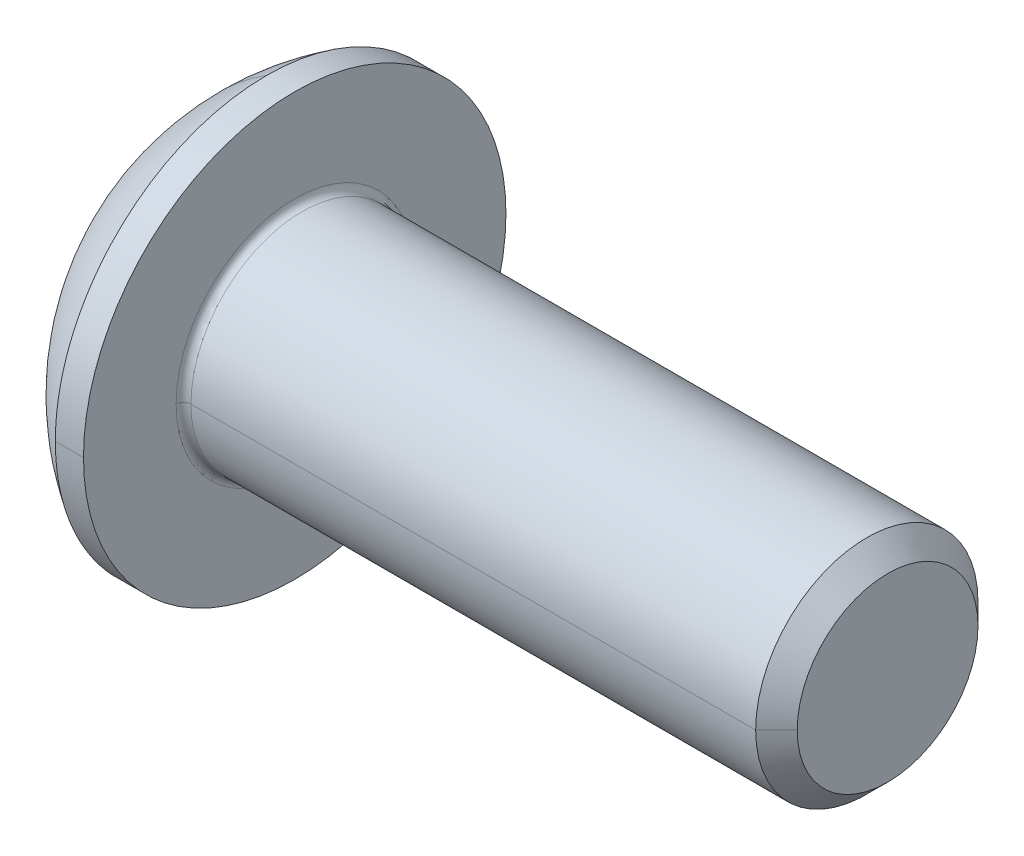
ISO-10303-21;
HEADER;
FILE_DESCRIPTION(('STEP AP214'),'2;1');
FILE_NAME('part.step','',(''),(''),'','','');
FILE_SCHEMA(('AUTOMOTIVE_DESIGN { 1 0 10303 214 1 1 1 1 }'));
ENDSEC;
DATA;
#1=APPLICATION_CONTEXT('core data for automotive mechanical design processes');
#2=APPLICATION_PROTOCOL_DEFINITION('international standard','automotive_design',2000,#1);
#3=PRODUCT_CONTEXT('',#1,'mechanical');
#4=PRODUCT('Part','Part','',(#3));
#5=PRODUCT_RELATED_PRODUCT_CATEGORY('part','',(#4));
#6=PRODUCT_DEFINITION_FORMATION('','',#4);
#7=PRODUCT_DEFINITION_CONTEXT('part definition',#1,'design');
#8=PRODUCT_DEFINITION('design','',#6,#7);
#9=PRODUCT_DEFINITION_SHAPE('','',#8);
#10=(LENGTH_UNIT() NAMED_UNIT(*) SI_UNIT(.MILLI.,.METRE.));
#11=(NAMED_UNIT(*) PLANE_ANGLE_UNIT() SI_UNIT($,.RADIAN.));
#12=(NAMED_UNIT(*) SI_UNIT($,.STERADIAN.) SOLID_ANGLE_UNIT());
#13=UNCERTAINTY_MEASURE_WITH_UNIT(LENGTH_MEASURE(1.E-05),#10,'distance_accuracy_value','');
#14=(GEOMETRIC_REPRESENTATION_CONTEXT(3) GLOBAL_UNCERTAINTY_ASSIGNED_CONTEXT((#13)) GLOBAL_UNIT_ASSIGNED_CONTEXT((#10,
#11,#12)) REPRESENTATION_CONTEXT('',''));
#15=CARTESIAN_POINT('',(0.,0.,0.));
#16=DIRECTION('',(0.,0.,1.));
#17=DIRECTION('',(1.,0.,0.));
#18=AXIS2_PLACEMENT_3D('',#15,#16,#17);
#19=CARTESIAN_POINT('',(-998.38264973081,0.,0.));
#20=DIRECTION('',(-1.,0.,0.));
#21=DIRECTION('',(0.,0.,1.));
#22=AXIS2_PLACEMENT_3D('',#19,#20,#21);
#23=CONICAL_SURFACE('',#22,1732.05080756885,1.0471975511966);
#24=DIRECTION('',(-0.5,0.,-0.866025403784436));
#25=VECTOR('',#24,1.);
#26=CARTESIAN_POINT('',(1.61735026918964,0.,0.));
#27=LINE('',#26,#25);
#28=CARTESIAN_POINT('',(1.61735026918964,0.,0.));
#29=VERTEX_POINT('',#28);
#30=CARTESIAN_POINT('',(1.04,0.,-1.));
#31=VERTEX_POINT('',#30);
#32=EDGE_CURVE('E219',#29,#31,#27,.T.);
#33=ORIENTED_EDGE('',*,*,#32,.F.);
#34=DIRECTION('',(-0.5,0.,0.866025403784436));
#35=VECTOR('',#34,1.);
#36=CARTESIAN_POINT('',(1.61735026918964,0.,0.));
#37=LINE('',#36,#35);
#38=CARTESIAN_POINT('',(1.04,0.,1.));
#39=VERTEX_POINT('',#38);
#40=EDGE_CURVE('E226',#29,#39,#37,.T.);
#41=ORIENTED_EDGE('',*,*,#40,.T.);
#42=CARTESIAN_POINT('',(1.04,0.,0.));
#43=DIRECTION('',(-1.,0.,0.));
#44=DIRECTION('',(0.,0.,1.));
#45=AXIS2_PLACEMENT_3D('',#42,#43,#44);
#46=CIRCLE('',#45,1.);
#47=CARTESIAN_POINT('',(1.04,0.86602540378444,0.5));
#48=VERTEX_POINT('',#47);
#49=EDGE_CURVE('E11',#39,#48,#46,.T.);
#50=ORIENTED_EDGE('',*,*,#49,.T.);
#51=CARTESIAN_POINT('',(1.04,0.,0.));
#52=DIRECTION('',(-1.,0.,0.));
#53=DIRECTION('',(0.,0.,1.));
#54=AXIS2_PLACEMENT_3D('',#51,#52,#53);
#55=CIRCLE('',#54,1.);
#56=CARTESIAN_POINT('',(1.04,0.86602540378444,-0.5));
#57=VERTEX_POINT('',#56);
#58=EDGE_CURVE('E25',#48,#57,#55,.T.);
#59=ORIENTED_EDGE('',*,*,#58,.T.);
#60=CARTESIAN_POINT('',(1.04,0.,0.));
#61=DIRECTION('',(-1.,0.,0.));
#62=DIRECTION('',(0.,0.,1.));
#63=AXIS2_PLACEMENT_3D('',#60,#61,#62);
#64=CIRCLE('',#63,1.);
#65=EDGE_CURVE('E19',#57,#31,#64,.T.);
#66=ORIENTED_EDGE('',*,*,#65,.T.);
#67=EDGE_LOOP('',(#33,#41,#50,#59,#66));
#68=FACE_BOUND('',#67,.T.);
#69=ADVANCED_FACE('F16',(#68),#23,.F.);
#70=CARTESIAN_POINT('',(1.04,-1.73205080756887,-1.));
#71=DIRECTION('',(1.,0.,0.));
#72=DIRECTION('',(0.,1.,0.));
#73=AXIS2_PLACEMENT_3D('',#70,#71,#72);
#74=PLANE('',#73);
#75=CARTESIAN_POINT('',(1.04,0.,0.));
#76=DIRECTION('',(-1.,0.,0.));
#77=DIRECTION('',(0.,0.,1.));
#78=AXIS2_PLACEMENT_3D('',#75,#76,#77);
#79=CIRCLE('',#78,1.);
#80=CARTESIAN_POINT('',(1.04,-0.86602540378444,-0.5));
#81=VERTEX_POINT('',#80);
#82=EDGE_CURVE('E187',#31,#81,#79,.T.);
#83=ORIENTED_EDGE('',*,*,#82,.F.);
#84=DIRECTION('',(0.,1.,0.));
#85=VECTOR('',#84,1.);
#86=CARTESIAN_POINT('',(1.04,0.577350269189628,-1.));
#87=LINE('',#86,#85);
#88=CARTESIAN_POINT('',(1.04,-0.577350269189626,-1.));
#89=VERTEX_POINT('',#88);
#90=EDGE_CURVE('E190',#89,#31,#87,.T.);
#91=ORIENTED_EDGE('',*,*,#90,.F.);
#92=DIRECTION('',(0.,0.5,-0.86602540378444));
#93=VECTOR('',#92,1.);
#94=CARTESIAN_POINT('',(1.04,-0.577350269189626,-1.));
#95=LINE('',#94,#93);
#96=EDGE_CURVE('E183',#81,#89,#95,.T.);
#97=ORIENTED_EDGE('',*,*,#96,.F.);
#98=EDGE_LOOP('',(#83,#91,#97));
#99=FACE_BOUND('',#98,.T.);
#100=ADVANCED_FACE('F185',(#99),#74,.F.);
#101=CARTESIAN_POINT('',(1.04,-1.73205080756887,-1.));
#102=DIRECTION('',(1.,0.,0.));
#103=DIRECTION('',(0.,1.,0.));
#104=AXIS2_PLACEMENT_3D('',#101,#102,#103);
#105=PLANE('',#104);
#106=CARTESIAN_POINT('',(1.04,0.,0.));
#107=DIRECTION('',(-1.,0.,0.));
#108=DIRECTION('',(0.,0.,1.));
#109=AXIS2_PLACEMENT_3D('',#106,#107,#108);
#110=CIRCLE('',#109,1.);
#111=CARTESIAN_POINT('',(1.04,-0.866025403784437,0.5));
#112=VERTEX_POINT('',#111);
#113=EDGE_CURVE('E208',#81,#112,#110,.T.);
#114=ORIENTED_EDGE('',*,*,#113,.F.);
#115=DIRECTION('',(0.,0.5,-0.86602540378444));
#116=VECTOR('',#115,1.);
#117=CARTESIAN_POINT('',(1.04,-0.577350269189626,-1.));
#118=LINE('',#117,#116);
#119=CARTESIAN_POINT('',(1.04,-1.15470053837925,0.));
#120=VERTEX_POINT('',#119);
#121=EDGE_CURVE('E195',#120,#81,#118,.T.);
#122=ORIENTED_EDGE('',*,*,#121,.F.);
#123=DIRECTION('',(0.,-0.5,-0.866025403784439));
#124=VECTOR('',#123,1.);
#125=CARTESIAN_POINT('',(1.04,-1.15470053837925,0.));
#126=LINE('',#125,#124);
#127=EDGE_CURVE('E210',#112,#120,#126,.T.);
#128=ORIENTED_EDGE('',*,*,#127,.F.);
#129=EDGE_LOOP('',(#114,#122,#128));
#130=FACE_BOUND('',#129,.T.);
#131=ADVANCED_FACE('F209',(#130),#105,.F.);
#132=CARTESIAN_POINT('',(1.04,-1.73205080756887,-1.));
#133=DIRECTION('',(1.,0.,0.));
#134=DIRECTION('',(0.,1.,0.));
#135=AXIS2_PLACEMENT_3D('',#132,#133,#134);
#136=PLANE('',#135);
#137=CARTESIAN_POINT('',(1.04,0.,0.));
#138=DIRECTION('',(-1.,0.,0.));
#139=DIRECTION('',(0.,0.,1.));
#140=AXIS2_PLACEMENT_3D('',#137,#138,#139);
#141=CIRCLE('',#140,1.);
#142=EDGE_CURVE('E215',#112,#39,#141,.T.);
#143=ORIENTED_EDGE('',*,*,#142,.F.);
#144=DIRECTION('',(0.,-0.5,-0.866025403784439));
#145=VECTOR('',#144,1.);
#146=CARTESIAN_POINT('',(1.04,-1.15470053837925,0.));
#147=LINE('',#146,#145);
#148=CARTESIAN_POINT('',(1.04,-0.577350269189625,1.));
#149=VERTEX_POINT('',#148);
#150=EDGE_CURVE('E371',#149,#112,#147,.T.);
#151=ORIENTED_EDGE('',*,*,#150,.F.);
#152=DIRECTION('',(0.,-1.,0.));
#153=VECTOR('',#152,1.);
#154=CARTESIAN_POINT('',(1.04,-0.577350269189625,1.));
#155=LINE('',#154,#153);
#156=EDGE_CURVE('E397',#39,#149,#155,.T.);
#157=ORIENTED_EDGE('',*,*,#156,.F.);
#158=EDGE_LOOP('',(#143,#151,#157));
#159=FACE_BOUND('',#158,.T.);
#160=ADVANCED_FACE('F426',(#159),#136,.F.);
#161=CARTESIAN_POINT('',(1.04,-1.73205080756887,-1.));
#162=DIRECTION('',(1.,0.,0.));
#163=DIRECTION('',(0.,1.,0.));
#164=AXIS2_PLACEMENT_3D('',#161,#162,#163);
#165=PLANE('',#164);
#166=ORIENTED_EDGE('',*,*,#49,.F.);
#167=DIRECTION('',(0.,-1.,0.));
#168=VECTOR('',#167,1.);
#169=CARTESIAN_POINT('',(1.04,-0.577350269189625,1.));
#170=LINE('',#169,#168);
#171=CARTESIAN_POINT('',(1.04,0.577350269189628,1.));
#172=VERTEX_POINT('',#171);
#173=EDGE_CURVE('E39',#172,#39,#170,.T.);
#174=ORIENTED_EDGE('',*,*,#173,.F.);
#175=DIRECTION('',(0.,-0.5,0.86602540378444));
#176=VECTOR('',#175,1.);
#177=CARTESIAN_POINT('',(1.04,0.577350269189628,1.));
#178=LINE('',#177,#176);
#179=EDGE_CURVE('E301',#48,#172,#178,.T.);
#180=ORIENTED_EDGE('',*,*,#179,.F.);
#181=EDGE_LOOP('',(#166,#174,#180));
#182=FACE_BOUND('',#181,.T.);
#183=ADVANCED_FACE('F871',(#182),#165,.F.);
#184=CARTESIAN_POINT('',(1.04,-1.73205080756887,-1.));
#185=DIRECTION('',(1.,0.,0.));
#186=DIRECTION('',(0.,1.,0.));
#187=AXIS2_PLACEMENT_3D('',#184,#185,#186);
#188=PLANE('',#187);
#189=ORIENTED_EDGE('',*,*,#58,.F.);
#190=DIRECTION('',(0.,-0.5,0.86602540378444));
#191=VECTOR('',#190,1.);
#192=CARTESIAN_POINT('',(1.04,0.577350269189628,1.));
#193=LINE('',#192,#191);
#194=CARTESIAN_POINT('',(1.04,1.15470053837925,0.));
#195=VERTEX_POINT('',#194);
#196=EDGE_CURVE('E297',#195,#48,#193,.T.);
#197=ORIENTED_EDGE('',*,*,#196,.F.);
#198=DIRECTION('',(0.,0.5,0.86602540378444));
#199=VECTOR('',#198,1.);
#200=CARTESIAN_POINT('',(1.04,1.15470053837925,0.));
#201=LINE('',#200,#199);
#202=EDGE_CURVE('E269',#57,#195,#201,.T.);
#203=ORIENTED_EDGE('',*,*,#202,.F.);
#204=EDGE_LOOP('',(#189,#197,#203));
#205=FACE_BOUND('',#204,.T.);
#206=ADVANCED_FACE('F866',(#205),#188,.F.);
#207=CARTESIAN_POINT('',(1.04,-1.73205080756887,-1.));
#208=DIRECTION('',(1.,0.,0.));
#209=DIRECTION('',(0.,1.,0.));
#210=AXIS2_PLACEMENT_3D('',#207,#208,#209);
#211=PLANE('',#210);
#212=ORIENTED_EDGE('',*,*,#65,.F.);
#213=DIRECTION('',(0.,0.5,0.86602540378444));
#214=VECTOR('',#213,1.);
#215=CARTESIAN_POINT('',(1.04,1.15470053837925,0.));
#216=LINE('',#215,#214);
#217=CARTESIAN_POINT('',(1.04,0.577350269189628,-1.));
#218=VERTEX_POINT('',#217);
#219=EDGE_CURVE('E265',#218,#57,#216,.T.);
#220=ORIENTED_EDGE('',*,*,#219,.F.);
#221=DIRECTION('',(0.,1.,0.));
#222=VECTOR('',#221,1.);
#223=CARTESIAN_POINT('',(1.04,0.577350269189628,-1.));
#224=LINE('',#223,#222);
#225=EDGE_CURVE('E368',#31,#218,#224,.T.);
#226=ORIENTED_EDGE('',*,*,#225,.F.);
#227=EDGE_LOOP('',(#212,#220,#226));
#228=FACE_BOUND('',#227,.T.);
#229=ADVANCED_FACE('F411',(#228),#211,.F.);
#230=CARTESIAN_POINT('',(1.04,-0.577350269189625,1.));
#231=DIRECTION('',(0.,0.,-1.));
#232=DIRECTION('',(-1.,0.,0.));
#233=AXIS2_PLACEMENT_3D('',#230,#231,#232);
#234=PLANE('',#233);
#235=ORIENTED_EDGE('',*,*,#173,.T.);
#236=ORIENTED_EDGE('',*,*,#156,.T.);
#237=DIRECTION('',(-1.,0.,0.));
#238=VECTOR('',#237,1.);
#239=CARTESIAN_POINT('',(1.04,-0.577350269189625,1.));
#240=LINE('',#239,#238);
#241=CARTESIAN_POINT('',(0.,-0.577350269189625,1.));
#242=VERTEX_POINT('',#241);
#243=EDGE_CURVE('E205',#149,#242,#240,.T.);
#244=ORIENTED_EDGE('',*,*,#243,.T.);
#245=DIRECTION('',(0.,-1.,0.));
#246=VECTOR('',#245,1.);
#247=CARTESIAN_POINT('',(0.,-0.577350269189625,1.));
#248=LINE('',#247,#246);
#249=CARTESIAN_POINT('',(0.,0.577350269189628,1.));
#250=VERTEX_POINT('',#249);
#251=EDGE_CURVE('E325',#250,#242,#248,.T.);
#252=ORIENTED_EDGE('',*,*,#251,.F.);
#253=DIRECTION('',(-1.,0.,0.));
#254=VECTOR('',#253,1.);
#255=CARTESIAN_POINT('',(1.04,0.577350269189628,1.));
#256=LINE('',#255,#254);
#257=EDGE_CURVE('E393',#172,#250,#256,.T.);
#258=ORIENTED_EDGE('',*,*,#257,.F.);
#259=EDGE_LOOP('',(#235,#236,#244,#252,#258));
#260=FACE_BOUND('',#259,.T.);
#261=ADVANCED_FACE('F892',(#260),#234,.T.);
#262=CARTESIAN_POINT('',(1.04,0.577350269189628,1.));
#263=DIRECTION('',(0.,-0.86602540378444,-0.5));
#264=DIRECTION('',(0.,0.5,-0.86602540378444));
#265=AXIS2_PLACEMENT_3D('',#262,#263,#264);
#266=PLANE('',#265);
#267=ORIENTED_EDGE('',*,*,#196,.T.);
#268=ORIENTED_EDGE('',*,*,#179,.T.);
#269=ORIENTED_EDGE('',*,*,#257,.T.);
#270=DIRECTION('',(0.,-0.5,0.86602540378444));
#271=VECTOR('',#270,1.);
#272=CARTESIAN_POINT('',(0.,0.577350269189628,1.));
#273=LINE('',#272,#271);
#274=CARTESIAN_POINT('',(0.,1.15470053837925,0.));
#275=VERTEX_POINT('',#274);
#276=EDGE_CURVE('E349',#275,#250,#273,.T.);
#277=ORIENTED_EDGE('',*,*,#276,.F.);
#278=DIRECTION('',(-1.,0.,0.));
#279=VECTOR('',#278,1.);
#280=CARTESIAN_POINT('',(1.04,1.15470053837925,0.));
#281=LINE('',#280,#279);
#282=EDGE_CURVE('E302',#195,#275,#281,.T.);
#283=ORIENTED_EDGE('',*,*,#282,.F.);
#284=EDGE_LOOP('',(#267,#268,#269,#277,#283));
#285=FACE_BOUND('',#284,.T.);
#286=ADVANCED_FACE('F882',(#285),#266,.T.);
#287=CARTESIAN_POINT('',(1.04,1.15470053837925,0.));
#288=DIRECTION('',(0.,-0.86602540378444,0.5));
#289=DIRECTION('',(-1.,0.,0.));
#290=AXIS2_PLACEMENT_3D('',#287,#288,#289);
#291=PLANE('',#290);
#292=ORIENTED_EDGE('',*,*,#219,.T.);
#293=ORIENTED_EDGE('',*,*,#202,.T.);
#294=ORIENTED_EDGE('',*,*,#282,.T.);
#295=DIRECTION('',(0.,0.5,0.86602540378444));
#296=VECTOR('',#295,1.);
#297=CARTESIAN_POINT('',(0.,1.15470053837925,0.));
#298=LINE('',#297,#296);
#299=CARTESIAN_POINT('',(0.,0.577350269189628,-1.));
#300=VERTEX_POINT('',#299);
#301=EDGE_CURVE('E343',#300,#275,#298,.T.);
#302=ORIENTED_EDGE('',*,*,#301,.F.);
#303=DIRECTION('',(-1.,0.,0.));
#304=VECTOR('',#303,1.);
#305=CARTESIAN_POINT('',(1.04,0.577350269189628,-1.));
#306=LINE('',#305,#304);
#307=EDGE_CURVE('E270',#218,#300,#306,.T.);
#308=ORIENTED_EDGE('',*,*,#307,.F.);
#309=EDGE_LOOP('',(#292,#293,#294,#302,#308));
#310=FACE_BOUND('',#309,.T.);
#311=ADVANCED_FACE('F860',(#310),#291,.T.);
#312=CARTESIAN_POINT('',(1.04,0.577350269189628,-1.));
#313=DIRECTION('',(0.,0.,1.));
#314=DIRECTION('',(1.,0.,0.));
#315=AXIS2_PLACEMENT_3D('',#312,#313,#314);
#316=PLANE('',#315);
#317=ORIENTED_EDGE('',*,*,#90,.T.);
#318=ORIENTED_EDGE('',*,*,#225,.T.);
#319=ORIENTED_EDGE('',*,*,#307,.T.);
#320=DIRECTION('',(0.,1.,0.));
#321=VECTOR('',#320,1.);
#322=CARTESIAN_POINT('',(0.,0.577350269189628,-1.));
#323=LINE('',#322,#321);
#324=CARTESIAN_POINT('',(0.,-0.577350269189626,-1.));
#325=VERTEX_POINT('',#324);
#326=EDGE_CURVE('E338',#325,#300,#323,.T.);
#327=ORIENTED_EDGE('',*,*,#326,.F.);
#328=DIRECTION('',(-1.,0.,0.));
#329=VECTOR('',#328,1.);
#330=CARTESIAN_POINT('',(1.04,-0.577350269189626,-1.));
#331=LINE('',#330,#329);
#332=EDGE_CURVE('E194',#89,#325,#331,.T.);
#333=ORIENTED_EDGE('',*,*,#332,.F.);
#334=EDGE_LOOP('',(#317,#318,#319,#327,#333));
#335=FACE_BOUND('',#334,.T.);
#336=ADVANCED_FACE('F414',(#335),#316,.T.);
#337=CARTESIAN_POINT('',(1.04,-0.577350269189626,-1.));
#338=DIRECTION('',(0.,0.86602540378444,0.5));
#339=DIRECTION('',(1.,0.,0.));
#340=AXIS2_PLACEMENT_3D('',#337,#338,#339);
#341=PLANE('',#340);
#342=ORIENTED_EDGE('',*,*,#121,.T.);
#343=ORIENTED_EDGE('',*,*,#96,.T.);
#344=ORIENTED_EDGE('',*,*,#332,.T.);
#345=DIRECTION('',(0.,0.5,-0.86602540378444));
#346=VECTOR('',#345,1.);
#347=CARTESIAN_POINT('',(0.,-0.577350269189626,-1.));
#348=LINE('',#347,#346);
#349=CARTESIAN_POINT('',(0.,-1.15470053837925,0.));
#350=VERTEX_POINT('',#349);
#351=EDGE_CURVE('E335',#350,#325,#348,.T.);
#352=ORIENTED_EDGE('',*,*,#351,.F.);
#353=DIRECTION('',(-1.,0.,0.));
#354=VECTOR('',#353,1.);
#355=CARTESIAN_POINT('',(1.04,-1.15470053837925,0.));
#356=LINE('',#355,#354);
#357=EDGE_CURVE('E201',#120,#350,#356,.T.);
#358=ORIENTED_EDGE('',*,*,#357,.F.);
#359=EDGE_LOOP('',(#342,#343,#344,#352,#358));
#360=FACE_BOUND('',#359,.T.);
#361=ADVANCED_FACE('F199',(#360),#341,.T.);
#362=CARTESIAN_POINT('',(1.04,-1.15470053837925,0.));
#363=DIRECTION('',(0.,0.866025403784439,-0.5));
#364=DIRECTION('',(-1.,0.,0.));
#365=AXIS2_PLACEMENT_3D('',#362,#363,#364);
#366=PLANE('',#365);
#367=ORIENTED_EDGE('',*,*,#150,.T.);
#368=ORIENTED_EDGE('',*,*,#127,.T.);
#369=ORIENTED_EDGE('',*,*,#357,.T.);
#370=DIRECTION('',(0.,-0.5,-0.866025403784439));
#371=VECTOR('',#370,1.);
#372=CARTESIAN_POINT('',(0.,-1.15470053837925,0.));
#373=LINE('',#372,#371);
#374=EDGE_CURVE('E329',#242,#350,#373,.T.);
#375=ORIENTED_EDGE('',*,*,#374,.F.);
#376=ORIENTED_EDGE('',*,*,#243,.F.);
#377=EDGE_LOOP('',(#367,#368,#369,#375,#376));
#378=FACE_BOUND('',#377,.T.);
#379=ADVANCED_FACE('F422',(#378),#366,.T.);
#380=CARTESIAN_POINT('',(1.75,0.,0.));
#381=DIRECTION('',(-1.,0.,0.));
#382=DIRECTION('',(0.,0.,1.));
#383=AXIS2_PLACEMENT_3D('',#380,#381,#382);
#384=TOROIDAL_SURFACE('',#383,1.6,0.1);
#385=CARTESIAN_POINT('',(1.75,0.,-1.6));
#386=DIRECTION('',(0.,1.,0.));
#387=DIRECTION('',(0.,0.,1.));
#388=AXIS2_PLACEMENT_3D('',#385,#386,#387);
#389=CIRCLE('',#388,0.1);
#390=CARTESIAN_POINT('',(1.65,0.,-1.6));
#391=VERTEX_POINT('',#390);
#392=CARTESIAN_POINT('',(1.75,0.,-1.5));
#393=VERTEX_POINT('',#392);
#394=EDGE_CURVE('E247',#391,#393,#389,.T.);
#395=ORIENTED_EDGE('',*,*,#394,.F.);
#396=CARTESIAN_POINT('',(1.65,0.,0.));
#397=DIRECTION('',(-1.,0.,0.));
#398=DIRECTION('',(0.,0.,1.));
#399=AXIS2_PLACEMENT_3D('',#396,#397,#398);
#400=CIRCLE('',#399,1.6);
#401=CARTESIAN_POINT('',(1.65,0.,1.6));
#402=VERTEX_POINT('',#401);
#403=EDGE_CURVE('E359',#402,#391,#400,.T.);
#404=ORIENTED_EDGE('',*,*,#403,.F.);
#405=CARTESIAN_POINT('',(1.75,0.,1.6));
#406=DIRECTION('',(0.,-1.,0.));
#407=DIRECTION('',(0.,0.,-1.));
#408=AXIS2_PLACEMENT_3D('',#405,#406,#407);
#409=CIRCLE('',#408,0.1);
#410=CARTESIAN_POINT('',(1.75,0.,1.5));
#411=VERTEX_POINT('',#410);
#412=EDGE_CURVE('E235',#402,#411,#409,.T.);
#413=ORIENTED_EDGE('',*,*,#412,.T.);
#414=CARTESIAN_POINT('',(1.75,0.,0.));
#415=DIRECTION('',(1.,0.,0.));
#416=DIRECTION('',(0.,0.,1.));
#417=AXIS2_PLACEMENT_3D('',#414,#415,#416);
#418=CIRCLE('',#417,1.5);
#419=EDGE_CURVE('E261',#393,#411,#418,.T.);
#420=ORIENTED_EDGE('',*,*,#419,.F.);
#421=EDGE_LOOP('',(#395,#404,#413,#420));
#422=FACE_BOUND('',#421,.T.);
#423=ADVANCED_FACE('F822',(#422),#384,.F.);
#424=CARTESIAN_POINT('',(9.65,0.,0.));
#425=DIRECTION('',(-1.,0.,0.));
#426=DIRECTION('',(0.,0.,1.));
#427=AXIS2_PLACEMENT_3D('',#424,#425,#426);
#428=PLANE('',#427);
#429=CARTESIAN_POINT('',(9.65,0.,0.));
#430=DIRECTION('',(-1.,0.,0.));
#431=DIRECTION('',(0.,0.,1.));
#432=AXIS2_PLACEMENT_3D('',#429,#430,#431);
#433=CIRCLE('',#432,1.2195);
#434=CARTESIAN_POINT('',(9.65,0.,1.2195));
#435=VERTEX_POINT('',#434);
#436=CARTESIAN_POINT('',(9.65,0.,-1.2195));
#437=VERTEX_POINT('',#436);
#438=EDGE_CURVE('E231',#435,#437,#433,.T.);
#439=ORIENTED_EDGE('',*,*,#438,.F.);
#440=CARTESIAN_POINT('',(9.65,0.,0.));
#441=DIRECTION('',(-1.,0.,0.));
#442=DIRECTION('',(0.,0.,1.));
#443=AXIS2_PLACEMENT_3D('',#440,#441,#442);
#444=CIRCLE('',#443,1.2195);
#445=EDGE_CURVE('E365',#437,#435,#444,.T.);
#446=ORIENTED_EDGE('',*,*,#445,.F.);
#447=EDGE_LOOP('',(#439,#446));
#448=FACE_BOUND('',#447,.T.);
#449=ADVANCED_FACE('F798',(#448),#428,.F.);
#450=CARTESIAN_POINT('',(9.65,0.,0.));
#451=DIRECTION('',(-1.,0.,0.));
#452=DIRECTION('',(0.,0.,1.));
#453=AXIS2_PLACEMENT_3D('',#450,#451,#452);
#454=CONICAL_SURFACE('',#453,1.2195,0.785398163397442);
#455=DIRECTION('',(-0.707106781186552,0.,-0.707106781186543));
#456=VECTOR('',#455,1.);
#457=CARTESIAN_POINT('',(9.65,0.,-1.2195));
#458=LINE('',#457,#456);
#459=CARTESIAN_POINT('',(9.3695,0.,-1.5));
#460=VERTEX_POINT('',#459);
#461=EDGE_CURVE('E234',#437,#460,#458,.T.);
#462=ORIENTED_EDGE('',*,*,#461,.F.);
#463=ORIENTED_EDGE('',*,*,#445,.T.);
#464=DIRECTION('',(-0.707106781186552,0.,0.707106781186543));
#465=VECTOR('',#464,1.);
#466=CARTESIAN_POINT('',(9.65,0.,1.2195));
#467=LINE('',#466,#465);
#468=CARTESIAN_POINT('',(9.3695,0.,1.5));
#469=VERTEX_POINT('',#468);
#470=EDGE_CURVE('E237',#435,#469,#467,.T.);
#471=ORIENTED_EDGE('',*,*,#470,.T.);
#472=CARTESIAN_POINT('',(9.3695,0.,0.));
#473=DIRECTION('',(-1.,0.,0.));
#474=DIRECTION('',(0.,0.,1.));
#475=AXIS2_PLACEMENT_3D('',#472,#473,#474);
#476=CIRCLE('',#475,1.5);
#477=EDGE_CURVE('E362',#460,#469,#476,.T.);
#478=ORIENTED_EDGE('',*,*,#477,.F.);
#479=EDGE_LOOP('',(#462,#463,#471,#478));
#480=FACE_BOUND('',#479,.T.);
#481=ADVANCED_FACE('F792',(#480),#454,.T.);
#482=CARTESIAN_POINT('',(0.,0.,0.));
#483=DIRECTION('',(-1.,0.,0.));
#484=DIRECTION('',(0.,0.,1.));
#485=AXIS2_PLACEMENT_3D('',#482,#483,#484);
#486=CYLINDRICAL_SURFACE('',#485,1.5);
#487=DIRECTION('',(-1.,0.,0.));
#488=VECTOR('',#487,1.);
#489=CARTESIAN_POINT('',(0.,0.,-1.5));
#490=LINE('',#489,#488);
#491=EDGE_CURVE('E241',#460,#393,#490,.T.);
#492=ORIENTED_EDGE('',*,*,#491,.F.);
#493=ORIENTED_EDGE('',*,*,#477,.T.);
#494=DIRECTION('',(-1.,0.,0.));
#495=VECTOR('',#494,1.);
#496=CARTESIAN_POINT('',(0.,0.,1.5));
#497=LINE('',#496,#495);
#498=EDGE_CURVE('E277',#469,#411,#497,.T.);
#499=ORIENTED_EDGE('',*,*,#498,.T.);
#500=CARTESIAN_POINT('',(1.75,0.,0.));
#501=DIRECTION('',(1.,0.,0.));
#502=DIRECTION('',(0.,0.,1.));
#503=AXIS2_PLACEMENT_3D('',#500,#501,#502);
#504=CIRCLE('',#503,1.5);
#505=EDGE_CURVE('E254',#411,#393,#504,.T.);
#506=ORIENTED_EDGE('',*,*,#505,.T.);
#507=EDGE_LOOP('',(#492,#493,#499,#506));
#508=FACE_BOUND('',#507,.T.);
#509=ADVANCED_FACE('F797',(#508),#486,.T.);
#510=CARTESIAN_POINT('',(1.65,1.5,0.));
#511=DIRECTION('',(-1.,0.,0.));
#512=DIRECTION('',(0.,0.,1.));
#513=AXIS2_PLACEMENT_3D('',#510,#511,#512);
#514=PLANE('',#513);
#515=ORIENTED_EDGE('',*,*,#403,.T.);
#516=CARTESIAN_POINT('',(1.65,0.,0.));
#517=DIRECTION('',(-1.,0.,0.));
#518=DIRECTION('',(0.,0.,1.));
#519=AXIS2_PLACEMENT_3D('',#516,#517,#518);
#520=CIRCLE('',#519,1.6);
#521=EDGE_CURVE('E243',#391,#402,#520,.T.);
#522=ORIENTED_EDGE('',*,*,#521,.T.);
#523=EDGE_LOOP('',(#515,#522));
#524=FACE_BOUND('',#523,.T.);
#525=CARTESIAN_POINT('',(1.65,0.,0.));
#526=DIRECTION('',(-1.,0.,0.));
#527=DIRECTION('',(0.,0.,1.));
#528=AXIS2_PLACEMENT_3D('',#525,#526,#527);
#529=CIRCLE('',#528,2.85);
#530=CARTESIAN_POINT('',(1.65,0.,2.85));
#531=VERTEX_POINT('',#530);
#532=CARTESIAN_POINT('',(1.65,0.,-2.85));
#533=VERTEX_POINT('',#532);
#534=EDGE_CURVE('E280',#531,#533,#529,.T.);
#535=ORIENTED_EDGE('',*,*,#534,.F.);
#536=CARTESIAN_POINT('',(1.65,0.,0.));
#537=DIRECTION('',(-1.,0.,0.));
#538=DIRECTION('',(0.,0.,1.));
#539=AXIS2_PLACEMENT_3D('',#536,#537,#538);
#540=CIRCLE('',#539,2.85);
#541=EDGE_CURVE('E356',#533,#531,#540,.T.);
#542=ORIENTED_EDGE('',*,*,#541,.F.);
#543=EDGE_LOOP('',(#535,#542));
#544=FACE_BOUND('',#543,.T.);
#545=ADVANCED_FACE('F730',(#524,#544),#514,.F.);
#546=CARTESIAN_POINT('',(0.,0.,0.));
#547=DIRECTION('',(-1.,0.,0.));
#548=DIRECTION('',(0.,0.,1.));
#549=AXIS2_PLACEMENT_3D('',#546,#547,#548);
#550=CYLINDRICAL_SURFACE('',#549,2.85);
#551=DIRECTION('',(-1.,0.,0.));
#552=VECTOR('',#551,1.);
#553=CARTESIAN_POINT('',(0.,0.,-2.85));
#554=LINE('',#553,#552);
#555=CARTESIAN_POINT('',(1.27,0.,-2.85));
#556=VERTEX_POINT('',#555);
#557=EDGE_CURVE('E284',#533,#556,#554,.T.);
#558=ORIENTED_EDGE('',*,*,#557,.F.);
#559=ORIENTED_EDGE('',*,*,#541,.T.);
#560=DIRECTION('',(-1.,0.,0.));
#561=VECTOR('',#560,1.);
#562=CARTESIAN_POINT('',(0.,0.,2.85));
#563=LINE('',#562,#561);
#564=CARTESIAN_POINT('',(1.27,0.,2.85));
#565=VERTEX_POINT('',#564);
#566=EDGE_CURVE('E296',#531,#565,#563,.T.);
#567=ORIENTED_EDGE('',*,*,#566,.T.);
#568=CARTESIAN_POINT('',(1.27,0.,0.));
#569=DIRECTION('',(-1.,0.,0.));
#570=DIRECTION('',(0.,0.,1.));
#571=AXIS2_PLACEMENT_3D('',#568,#569,#570);
#572=CIRCLE('',#571,2.85);
#573=CARTESIAN_POINT('',(1.27,-2.85,0.));
#574=VERTEX_POINT('',#573);
#575=EDGE_CURVE('E353',#574,#565,#572,.T.);
#576=ORIENTED_EDGE('',*,*,#575,.F.);
#577=CARTESIAN_POINT('',(1.27,0.,0.));
#578=DIRECTION('',(-1.,0.,0.));
#579=DIRECTION('',(0.,0.,1.));
#580=AXIS2_PLACEMENT_3D('',#577,#578,#579);
#581=CIRCLE('',#580,2.85);
#582=EDGE_CURVE('E306',#556,#574,#581,.T.);
#583=ORIENTED_EDGE('',*,*,#582,.F.);
#584=EDGE_LOOP('',(#558,#559,#567,#576,#583));
#585=FACE_BOUND('',#584,.T.);
#586=ADVANCED_FACE('F724',(#585),#550,.T.);
#587=CARTESIAN_POINT('',(3.03337598425197,0.,0.));
#588=DIRECTION('',(0.,0.,-1.));
#589=DIRECTION('',(0.,1.,0.));
#590=AXIS2_PLACEMENT_3D('',#587,#588,#589);
#591=SPHERICAL_SURFACE('',#590,3.35141684393879);
#592=CARTESIAN_POINT('',(3.03337598425197,0.,0.));
#593=DIRECTION('',(0.,0.,-1.));
#594=DIRECTION('',(0.,1.,0.));
#595=AXIS2_PLACEMENT_3D('',#592,#593,#594);
#596=CIRCLE('',#595,3.35141684393879);
#597=CARTESIAN_POINT('',(0.,-1.425,0.));
#598=VERTEX_POINT('',#597);
#599=EDGE_CURVE('E310',#574,#598,#596,.T.);
#600=ORIENTED_EDGE('',*,*,#599,.F.);
#601=ORIENTED_EDGE('',*,*,#575,.T.);
#602=CARTESIAN_POINT('',(1.27,0.,0.));
#603=DIRECTION('',(-1.,0.,0.));
#604=DIRECTION('',(0.,0.,1.));
#605=AXIS2_PLACEMENT_3D('',#602,#603,#604);
#606=CIRCLE('',#605,2.85);
#607=CARTESIAN_POINT('',(1.27,2.85,0.));
#608=VERTEX_POINT('',#607);
#609=EDGE_CURVE('E292',#565,#608,#606,.T.);
#610=ORIENTED_EDGE('',*,*,#609,.T.);
#611=CARTESIAN_POINT('',(3.03337598425197,0.,0.));
#612=DIRECTION('',(0.,0.,1.));
#613=DIRECTION('',(1.,0.,0.));
#614=AXIS2_PLACEMENT_3D('',#611,#612,#613);
#615=CIRCLE('',#614,3.35141684393879);
#616=CARTESIAN_POINT('',(0.,1.425,0.));
#617=VERTEX_POINT('',#616);
#618=EDGE_CURVE('E318',#608,#617,#615,.T.);
#619=ORIENTED_EDGE('',*,*,#618,.T.);
#620=CARTESIAN_POINT('',(0.,0.,0.));
#621=DIRECTION('',(-1.,0.,0.));
#622=DIRECTION('',(0.,0.,1.));
#623=AXIS2_PLACEMENT_3D('',#620,#621,#622);
#624=CIRCLE('',#623,1.425);
#625=EDGE_CURVE('E322',#598,#617,#624,.T.);
#626=ORIENTED_EDGE('',*,*,#625,.F.);
#627=EDGE_LOOP('',(#600,#601,#610,#619,#626));
#628=FACE_BOUND('',#627,.T.);
#629=ADVANCED_FACE('F729',(#628),#591,.T.);
#630=CARTESIAN_POINT('',(0.,0.,0.));
#631=DIRECTION('',(-1.,0.,0.));
#632=DIRECTION('',(0.,0.,1.));
#633=AXIS2_PLACEMENT_3D('',#630,#631,#632);
#634=PLANE('',#633);
#635=ORIENTED_EDGE('',*,*,#251,.T.);
#636=ORIENTED_EDGE('',*,*,#374,.T.);
#637=ORIENTED_EDGE('',*,*,#351,.T.);
#638=ORIENTED_EDGE('',*,*,#326,.T.);
#639=ORIENTED_EDGE('',*,*,#301,.T.);
#640=ORIENTED_EDGE('',*,*,#276,.T.);
#641=EDGE_LOOP('',(#635,#636,#637,#638,#639,#640));
#642=FACE_BOUND('',#641,.T.);
#643=CARTESIAN_POINT('',(0.,0.,0.));
#644=DIRECTION('',(-1.,0.,0.));
#645=DIRECTION('',(0.,0.,1.));
#646=AXIS2_PLACEMENT_3D('',#643,#644,#645);
#647=CIRCLE('',#646,1.425);
#648=EDGE_CURVE('E314',#617,#598,#647,.T.);
#649=ORIENTED_EDGE('',*,*,#648,.T.);
#650=ORIENTED_EDGE('',*,*,#625,.T.);
#651=EDGE_LOOP('',(#649,#650));
#652=FACE_BOUND('',#651,.T.);
#653=ADVANCED_FACE('F418',(#642,#652),#634,.T.);
#654=CARTESIAN_POINT('',(3.03337598425197,0.,0.));
#655=DIRECTION('',(0.,0.,-1.));
#656=DIRECTION('',(0.,1.,0.));
#657=AXIS2_PLACEMENT_3D('',#654,#655,#656);
#658=SPHERICAL_SURFACE('',#657,3.35141684393879);
#659=CARTESIAN_POINT('',(1.27,0.,0.));
#660=DIRECTION('',(-1.,0.,0.));
#661=DIRECTION('',(0.,0.,1.));
#662=AXIS2_PLACEMENT_3D('',#659,#660,#661);
#663=CIRCLE('',#662,2.85);
#664=EDGE_CURVE('E288',#608,#556,#663,.T.);
#665=ORIENTED_EDGE('',*,*,#664,.T.);
#666=ORIENTED_EDGE('',*,*,#582,.T.);
#667=ORIENTED_EDGE('',*,*,#599,.T.);
#668=ORIENTED_EDGE('',*,*,#648,.F.);
#669=ORIENTED_EDGE('',*,*,#618,.F.);
#670=EDGE_LOOP('',(#665,#666,#667,#668,#669));
#671=FACE_BOUND('',#670,.T.);
#672=ADVANCED_FACE('F744',(#671),#658,.T.);
#673=CARTESIAN_POINT('',(0.,0.,0.));
#674=DIRECTION('',(-1.,0.,0.));
#675=DIRECTION('',(0.,0.,1.));
#676=AXIS2_PLACEMENT_3D('',#673,#674,#675);
#677=CYLINDRICAL_SURFACE('',#676,2.85);
#678=ORIENTED_EDGE('',*,*,#534,.T.);
#679=ORIENTED_EDGE('',*,*,#557,.T.);
#680=ORIENTED_EDGE('',*,*,#664,.F.);
#681=ORIENTED_EDGE('',*,*,#609,.F.);
#682=ORIENTED_EDGE('',*,*,#566,.F.);
#683=EDGE_LOOP('',(#678,#679,#680,#681,#682));
#684=FACE_BOUND('',#683,.T.);
#685=ADVANCED_FACE('F738',(#684),#677,.T.);
#686=CARTESIAN_POINT('',(0.,0.,0.));
#687=DIRECTION('',(-1.,0.,0.));
#688=DIRECTION('',(0.,0.,1.));
#689=AXIS2_PLACEMENT_3D('',#686,#687,#688);
#690=CYLINDRICAL_SURFACE('',#689,1.5);
#691=CARTESIAN_POINT('',(9.3695,0.,0.));
#692=DIRECTION('',(-1.,0.,0.));
#693=DIRECTION('',(0.,0.,1.));
#694=AXIS2_PLACEMENT_3D('',#691,#692,#693);
#695=CIRCLE('',#694,1.5);
#696=EDGE_CURVE('E242',#469,#460,#695,.T.);
#697=ORIENTED_EDGE('',*,*,#696,.T.);
#698=ORIENTED_EDGE('',*,*,#491,.T.);
#699=ORIENTED_EDGE('',*,*,#419,.T.);
#700=ORIENTED_EDGE('',*,*,#498,.F.);
#701=EDGE_LOOP('',(#697,#698,#699,#700));
#702=FACE_BOUND('',#701,.T.);
#703=ADVANCED_FACE('F743',(#702),#690,.T.);
#704=CARTESIAN_POINT('',(9.65,0.,0.));
#705=DIRECTION('',(-1.,0.,0.));
#706=DIRECTION('',(0.,0.,1.));
#707=AXIS2_PLACEMENT_3D('',#704,#705,#706);
#708=CONICAL_SURFACE('',#707,1.2195,0.785398163397442);
#709=ORIENTED_EDGE('',*,*,#438,.T.);
#710=ORIENTED_EDGE('',*,*,#461,.T.);
#711=ORIENTED_EDGE('',*,*,#696,.F.);
#712=ORIENTED_EDGE('',*,*,#470,.F.);
#713=EDGE_LOOP('',(#709,#710,#711,#712));
#714=FACE_BOUND('',#713,.T.);
#715=ADVANCED_FACE('F717',(#714),#708,.T.);
#716=CARTESIAN_POINT('',(1.75,0.,0.));
#717=DIRECTION('',(-1.,0.,0.));
#718=DIRECTION('',(0.,0.,1.));
#719=AXIS2_PLACEMENT_3D('',#716,#717,#718);
#720=TOROIDAL_SURFACE('',#719,1.6,0.1);
#721=ORIENTED_EDGE('',*,*,#521,.F.);
#722=ORIENTED_EDGE('',*,*,#394,.T.);
#723=ORIENTED_EDGE('',*,*,#505,.F.);
#724=ORIENTED_EDGE('',*,*,#412,.F.);
#725=EDGE_LOOP('',(#721,#722,#723,#724));
#726=FACE_BOUND('',#725,.T.);
#727=ADVANCED_FACE('F708',(#726),#720,.F.);
#728=CARTESIAN_POINT('',(-998.38264973081,0.,0.));
#729=DIRECTION('',(-1.,0.,0.));
#730=DIRECTION('',(0.,0.,1.));
#731=AXIS2_PLACEMENT_3D('',#728,#729,#730);
#732=CONICAL_SURFACE('',#731,1732.05080756885,1.0471975511966);
#733=ORIENTED_EDGE('',*,*,#40,.F.);
#734=ORIENTED_EDGE('',*,*,#32,.T.);
#735=ORIENTED_EDGE('',*,*,#82,.T.);
#736=ORIENTED_EDGE('',*,*,#113,.T.);
#737=ORIENTED_EDGE('',*,*,#142,.T.);
#738=EDGE_LOOP('',(#733,#734,#735,#736,#737));
#739=FACE_BOUND('',#738,.T.);
#740=ADVANCED_FACE('F218',(#739),#732,.F.);
#741=CLOSED_SHELL('',(#69,#100,#131,#160,#183,#206,#229,#261,#286,#311,#336,#361,#379,#423,#449,
#481,#509,#545,#586,#629,#653,#672,#685,#703,#715,#727,#740));
#742=MANIFOLD_SOLID_BREP('B1',#741);
#743=ADVANCED_BREP_SHAPE_REPRESENTATION('',(#18,#742),#14);
#744=SHAPE_DEFINITION_REPRESENTATION(#9,#743);
ENDSEC;
END-ISO-10303-21;
